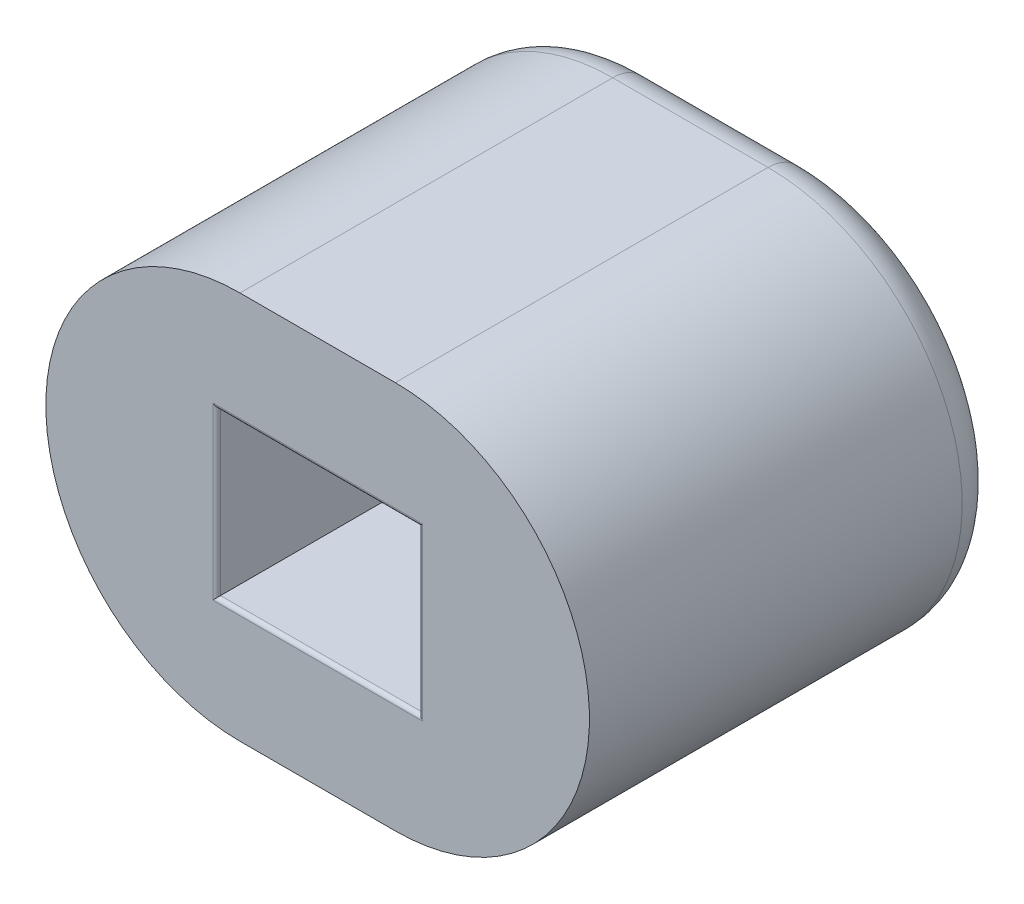
ISO-10303-21;
HEADER;
FILE_DESCRIPTION(('STEP AP214'),'2;1');
FILE_NAME('part.step','',(''),(''),'','','');
FILE_SCHEMA(('AUTOMOTIVE_DESIGN { 1 0 10303 214 1 1 1 1 }'));
ENDSEC;
DATA;
#1=APPLICATION_CONTEXT('core data for automotive mechanical design processes');
#2=APPLICATION_PROTOCOL_DEFINITION('international standard','automotive_design',2000,#1);
#3=PRODUCT_CONTEXT('',#1,'mechanical');
#4=PRODUCT('Part','Part','',(#3));
#5=PRODUCT_RELATED_PRODUCT_CATEGORY('part','',(#4));
#6=PRODUCT_DEFINITION_FORMATION('','',#4);
#7=PRODUCT_DEFINITION_CONTEXT('part definition',#1,'design');
#8=PRODUCT_DEFINITION('design','',#6,#7);
#9=PRODUCT_DEFINITION_SHAPE('','',#8);
#10=(LENGTH_UNIT() NAMED_UNIT(*) SI_UNIT(.MILLI.,.METRE.));
#11=(NAMED_UNIT(*) PLANE_ANGLE_UNIT() SI_UNIT($,.RADIAN.));
#12=(NAMED_UNIT(*) SI_UNIT($,.STERADIAN.) SOLID_ANGLE_UNIT());
#13=UNCERTAINTY_MEASURE_WITH_UNIT(LENGTH_MEASURE(1.E-05),#10,'distance_accuracy_value','');
#14=(GEOMETRIC_REPRESENTATION_CONTEXT(3) GLOBAL_UNCERTAINTY_ASSIGNED_CONTEXT((#13)) GLOBAL_UNIT_ASSIGNED_CONTEXT((#10,
#11,#12)) REPRESENTATION_CONTEXT('',''));
#15=CARTESIAN_POINT('',(0.,0.,0.));
#16=DIRECTION('',(0.,0.,1.));
#17=DIRECTION('',(1.,0.,0.));
#18=AXIS2_PLACEMENT_3D('',#15,#16,#17);
#19=CARTESIAN_POINT('',(0.,-50.8,-56.1));
#20=DIRECTION('',(0.,0.,-1.));
#21=DIRECTION('',(-1.,0.,0.));
#22=AXIS2_PLACEMENT_3D('',#19,#20,#21);
#23=PLANE('',#22);
#24=CARTESIAN_POINT('',(26.1,-49.2289699396619,-56.1));
#25=DIRECTION('',(0.,0.,-1.));
#26=DIRECTION('',(-1.,0.,0.));
#27=AXIS2_PLACEMENT_3D('',#24,#25,#26);
#28=CIRCLE('',#27,0.749999999999998);
#29=CARTESIAN_POINT('',(26.25,-48.4941230168269,-56.1));
#30=VERTEX_POINT('',#29);
#31=CARTESIAN_POINT('',(25.95,-48.4941230168269,-56.1));
#32=VERTEX_POINT('',#31);
#33=EDGE_CURVE('E191',#30,#32,#28,.T.);
#34=ORIENTED_EDGE('',*,*,#33,.F.);
#35=CARTESIAN_POINT('',(26.25,-48.519676619965,-56.1));
#36=DIRECTION('',(0.,0.,-1.));
#37=DIRECTION('',(-1.,0.,0.));
#38=AXIS2_PLACEMENT_3D('',#35,#36,#37);
#39=CIRCLE('',#38,0.0255536031380425);
#40=CARTESIAN_POINT('',(26.25,-48.545230223103,-56.1));
#41=VERTEX_POINT('',#40);
#42=EDGE_CURVE('E208',#30,#41,#39,.F.);
#43=ORIENTED_EDGE('',*,*,#42,.T.);
#44=CARTESIAN_POINT('',(26.1,-49.2289699396619,-56.1));
#45=DIRECTION('',(0.,0.,-1.));
#46=DIRECTION('',(-1.,0.,0.));
#47=AXIS2_PLACEMENT_3D('',#44,#45,#46);
#48=CIRCLE('',#47,0.699999999999999);
#49=CARTESIAN_POINT('',(25.95,-48.545230223103,-56.1));
#50=VERTEX_POINT('',#49);
#51=EDGE_CURVE('E211',#41,#50,#48,.T.);
#52=ORIENTED_EDGE('',*,*,#51,.T.);
#53=CARTESIAN_POINT('',(25.95,-48.519676619965,-56.1));
#54=DIRECTION('',(0.,0.,-1.));
#55=DIRECTION('',(-1.,0.,0.));
#56=AXIS2_PLACEMENT_3D('',#53,#54,#55);
#57=CIRCLE('',#56,0.0255536031380425);
#58=EDGE_CURVE('E220',#32,#50,#57,.T.);
#59=ORIENTED_EDGE('',*,*,#58,.F.);
#60=EDGE_LOOP('',(#34,#43,#52,#59));
#61=FACE_BOUND('',#60,.T.);
#62=CARTESIAN_POINT('',(27.1,-49.2289699396619,-56.1));
#63=DIRECTION('',(0.,0.,-1.));
#64=DIRECTION('',(-1.,0.,0.));
#65=AXIS2_PLACEMENT_3D('',#62,#63,#64);
#66=CIRCLE('',#65,2.);
#67=CARTESIAN_POINT('',(27.1,-47.2289699396619,-56.1));
#68=VERTEX_POINT('',#67);
#69=CARTESIAN_POINT('',(27.1,-51.2289699396619,-56.1));
#70=VERTEX_POINT('',#69);
#71=EDGE_CURVE('E289',#68,#70,#66,.T.);
#72=ORIENTED_EDGE('',*,*,#71,.T.);
#73=DIRECTION('',(-1.,0.,0.));
#74=VECTOR('',#73,1.);
#75=CARTESIAN_POINT('',(25.1,-51.2289699396619,-56.1));
#76=LINE('',#75,#74);
#77=CARTESIAN_POINT('',(25.1,-51.2289699396619,-56.1));
#78=VERTEX_POINT('',#77);
#79=EDGE_CURVE('E291',#70,#78,#76,.T.);
#80=ORIENTED_EDGE('',*,*,#79,.T.);
#81=CARTESIAN_POINT('',(25.1,-49.2289699396619,-56.1));
#82=DIRECTION('',(0.,0.,-1.));
#83=DIRECTION('',(-1.,0.,0.));
#84=AXIS2_PLACEMENT_3D('',#81,#82,#83);
#85=CIRCLE('',#84,2.);
#86=CARTESIAN_POINT('',(25.1,-47.2289699396619,-56.1));
#87=VERTEX_POINT('',#86);
#88=EDGE_CURVE('E285',#78,#87,#85,.T.);
#89=ORIENTED_EDGE('',*,*,#88,.T.);
#90=DIRECTION('',(1.,0.,0.));
#91=VECTOR('',#90,1.);
#92=CARTESIAN_POINT('',(27.1,-47.2289699396619,-56.1));
#93=LINE('',#92,#91);
#94=EDGE_CURVE('E287',#87,#68,#93,.T.);
#95=ORIENTED_EDGE('',*,*,#94,.T.);
#96=EDGE_LOOP('',(#72,#80,#89,#95));
#97=FACE_BOUND('',#96,.T.);
#98=CARTESIAN_POINT('',(26.1,-49.2289699396619,-56.1));
#99=DIRECTION('',(0.,0.,-1.));
#100=DIRECTION('',(-1.,0.,0.));
#101=AXIS2_PLACEMENT_3D('',#98,#99,#100);
#102=CIRCLE('',#101,0.0500000000000014);
#103=CARTESIAN_POINT('',(26.15,-49.2289699396619,-56.1));
#104=VERTEX_POINT('',#103);
#105=CARTESIAN_POINT('',(26.05,-49.2289699396619,-56.1));
#106=VERTEX_POINT('',#105);
#107=EDGE_CURVE('E246',#104,#106,#102,.T.);
#108=ORIENTED_EDGE('',*,*,#107,.F.);
#109=DIRECTION('',(0.,1.,0.));
#110=VECTOR('',#109,1.);
#111=CARTESIAN_POINT('',(26.15,-50.8,-56.1));
#112=LINE('',#111,#110);
#113=CARTESIAN_POINT('',(26.15,-48.2289699396619,-56.1));
#114=VERTEX_POINT('',#113);
#115=EDGE_CURVE('E227',#104,#114,#112,.T.);
#116=ORIENTED_EDGE('',*,*,#115,.T.);
#117=CARTESIAN_POINT('',(26.1,-48.2289699396619,-56.1));
#118=DIRECTION('',(0.,0.,-1.));
#119=DIRECTION('',(-1.,0.,0.));
#120=AXIS2_PLACEMENT_3D('',#117,#118,#119);
#121=CIRCLE('',#120,0.0500000000000014);
#122=CARTESIAN_POINT('',(26.05,-48.2289699396619,-56.1));
#123=VERTEX_POINT('',#122);
#124=EDGE_CURVE('E235',#114,#123,#121,.F.);
#125=ORIENTED_EDGE('',*,*,#124,.T.);
#126=DIRECTION('',(0.,1.,0.));
#127=VECTOR('',#126,1.);
#128=CARTESIAN_POINT('',(26.05,-50.8,-56.1));
#129=LINE('',#128,#127);
#130=EDGE_CURVE('E249',#106,#123,#129,.T.);
#131=ORIENTED_EDGE('',*,*,#130,.F.);
#132=EDGE_LOOP('',(#108,#116,#125,#131));
#133=FACE_BOUND('',#132,.T.);
#134=ADVANCED_FACE('F34',(#61,#97,#133),#23,.T.);
#135=CARTESIAN_POINT('',(0.,-46.7289699396619,-56.1));
#136=DIRECTION('',(0.,-1.,0.));
#137=DIRECTION('',(0.,0.,-1.));
#138=AXIS2_PLACEMENT_3D('',#135,#136,#137);
#139=PLANE('',#138);
#140=DIRECTION('',(0.,0.,1.));
#141=VECTOR('',#140,1.);
#142=CARTESIAN_POINT('',(27.1,-46.7289699396619,-56.1));
#143=LINE('',#142,#141);
#144=CARTESIAN_POINT('',(27.1,-46.7289699396619,-55.6));
#145=VERTEX_POINT('',#144);
#146=CARTESIAN_POINT('',(27.1,-46.7289699396619,-50.8));
#147=VERTEX_POINT('',#146);
#148=EDGE_CURVE('E283',#145,#147,#143,.T.);
#149=ORIENTED_EDGE('',*,*,#148,.F.);
#150=DIRECTION('',(1.,0.,0.));
#151=VECTOR('',#150,1.);
#152=CARTESIAN_POINT('',(25.1,-46.7289699396619,-55.6));
#153=LINE('',#152,#151);
#154=CARTESIAN_POINT('',(25.1,-46.7289699396619,-55.6));
#155=VERTEX_POINT('',#154);
#156=EDGE_CURVE('E299',#145,#155,#153,.F.);
#157=ORIENTED_EDGE('',*,*,#156,.T.);
#158=DIRECTION('',(0.,0.,1.));
#159=VECTOR('',#158,1.);
#160=CARTESIAN_POINT('',(25.1,-46.7289699396619,-56.1));
#161=LINE('',#160,#159);
#162=CARTESIAN_POINT('',(25.1,-46.7289699396619,-50.8));
#163=VERTEX_POINT('',#162);
#164=EDGE_CURVE('E277',#155,#163,#161,.T.);
#165=ORIENTED_EDGE('',*,*,#164,.T.);
#166=DIRECTION('',(1.,0.,0.));
#167=VECTOR('',#166,1.);
#168=CARTESIAN_POINT('',(0.,-46.7289699396619,-50.8));
#169=LINE('',#168,#167);
#170=EDGE_CURVE('E264',#163,#147,#169,.T.);
#171=ORIENTED_EDGE('',*,*,#170,.T.);
#172=EDGE_LOOP('',(#149,#157,#165,#171));
#173=FACE_BOUND('',#172,.T.);
#174=ADVANCED_FACE('F425',(#173),#139,.F.);
#175=CARTESIAN_POINT('',(27.1,-49.2289699396619,-56.1));
#176=DIRECTION('',(0.,0.,1.));
#177=DIRECTION('',(1.,0.,0.));
#178=AXIS2_PLACEMENT_3D('',#175,#176,#177);
#179=CYLINDRICAL_SURFACE('',#178,2.5);
#180=DIRECTION('',(0.,0.,1.));
#181=VECTOR('',#180,1.);
#182=CARTESIAN_POINT('',(27.1,-51.7289699396619,-56.1));
#183=LINE('',#182,#181);
#184=CARTESIAN_POINT('',(27.1,-51.7289699396619,-55.6));
#185=VERTEX_POINT('',#184);
#186=CARTESIAN_POINT('',(27.1,-51.7289699396619,-50.8));
#187=VERTEX_POINT('',#186);
#188=EDGE_CURVE('E281',#185,#187,#183,.T.);
#189=ORIENTED_EDGE('',*,*,#188,.F.);
#190=CARTESIAN_POINT('',(27.1,-49.2289699396619,-55.6));
#191=DIRECTION('',(0.,0.,-1.));
#192=DIRECTION('',(-1.,0.,0.));
#193=AXIS2_PLACEMENT_3D('',#190,#191,#192);
#194=CIRCLE('',#193,2.5);
#195=EDGE_CURVE('E297',#185,#145,#194,.F.);
#196=ORIENTED_EDGE('',*,*,#195,.T.);
#197=ORIENTED_EDGE('',*,*,#148,.T.);
#198=CARTESIAN_POINT('',(27.1,-49.2289699396619,-50.8));
#199=DIRECTION('',(0.,0.,-1.));
#200=DIRECTION('',(-1.,0.,0.));
#201=AXIS2_PLACEMENT_3D('',#198,#199,#200);
#202=CIRCLE('',#201,2.5);
#203=EDGE_CURVE('E267',#147,#187,#202,.T.);
#204=ORIENTED_EDGE('',*,*,#203,.T.);
#205=EDGE_LOOP('',(#189,#196,#197,#204));
#206=FACE_BOUND('',#205,.T.);
#207=ADVANCED_FACE('F431',(#206),#179,.T.);
#208=CARTESIAN_POINT('',(0.,-51.7289699396619,-56.1));
#209=DIRECTION('',(0.,1.,0.));
#210=DIRECTION('',(-1.,0.,0.));
#211=AXIS2_PLACEMENT_3D('',#208,#209,#210);
#212=PLANE('',#211);
#213=DIRECTION('',(0.,0.,1.));
#214=VECTOR('',#213,1.);
#215=CARTESIAN_POINT('',(25.1,-51.7289699396619,-56.1));
#216=LINE('',#215,#214);
#217=CARTESIAN_POINT('',(25.1,-51.7289699396619,-55.6));
#218=VERTEX_POINT('',#217);
#219=CARTESIAN_POINT('',(25.1,-51.7289699396619,-50.8));
#220=VERTEX_POINT('',#219);
#221=EDGE_CURVE('E279',#218,#220,#216,.T.);
#222=ORIENTED_EDGE('',*,*,#221,.F.);
#223=DIRECTION('',(-1.,0.,0.));
#224=VECTOR('',#223,1.);
#225=CARTESIAN_POINT('',(27.1,-51.7289699396619,-55.6));
#226=LINE('',#225,#224);
#227=EDGE_CURVE('E294',#218,#185,#226,.F.);
#228=ORIENTED_EDGE('',*,*,#227,.T.);
#229=ORIENTED_EDGE('',*,*,#188,.T.);
#230=DIRECTION('',(-1.,0.,0.));
#231=VECTOR('',#230,1.);
#232=CARTESIAN_POINT('',(0.,-51.7289699396619,-50.8));
#233=LINE('',#232,#231);
#234=EDGE_CURVE('E271',#187,#220,#233,.T.);
#235=ORIENTED_EDGE('',*,*,#234,.T.);
#236=EDGE_LOOP('',(#222,#228,#229,#235));
#237=FACE_BOUND('',#236,.T.);
#238=ADVANCED_FACE('F445',(#237),#212,.F.);
#239=CARTESIAN_POINT('',(25.1,-49.2289699396619,-56.1));
#240=DIRECTION('',(0.,0.,1.));
#241=DIRECTION('',(1.,0.,0.));
#242=AXIS2_PLACEMENT_3D('',#239,#240,#241);
#243=CYLINDRICAL_SURFACE('',#242,2.5);
#244=ORIENTED_EDGE('',*,*,#164,.F.);
#245=CARTESIAN_POINT('',(25.1,-49.2289699396619,-55.6));
#246=DIRECTION('',(0.,0.,-1.));
#247=DIRECTION('',(-1.,0.,0.));
#248=AXIS2_PLACEMENT_3D('',#245,#246,#247);
#249=CIRCLE('',#248,2.5);
#250=EDGE_CURVE('E301',#155,#218,#249,.F.);
#251=ORIENTED_EDGE('',*,*,#250,.T.);
#252=ORIENTED_EDGE('',*,*,#221,.T.);
#253=CARTESIAN_POINT('',(25.1,-49.2289699396619,-50.8));
#254=DIRECTION('',(0.,0.,-1.));
#255=DIRECTION('',(-1.,0.,0.));
#256=AXIS2_PLACEMENT_3D('',#253,#254,#255);
#257=CIRCLE('',#256,2.5);
#258=EDGE_CURVE('E274',#220,#163,#257,.T.);
#259=ORIENTED_EDGE('',*,*,#258,.T.);
#260=EDGE_LOOP('',(#244,#251,#252,#259));
#261=FACE_BOUND('',#260,.T.);
#262=ADVANCED_FACE('F442',(#261),#243,.T.);
#263=CARTESIAN_POINT('',(0.,-50.8,-50.8));
#264=DIRECTION('',(0.,0.,-1.));
#265=DIRECTION('',(-1.,0.,0.));
#266=AXIS2_PLACEMENT_3D('',#263,#264,#265);
#267=PLANE('',#266);
#268=DIRECTION('',(0.,1.,0.));
#269=VECTOR('',#268,1.);
#270=CARTESIAN_POINT('',(27.45,-50.8,-50.8));
#271=LINE('',#270,#269);
#272=CARTESIAN_POINT('',(27.45,-48.1289699396619,-50.8));
#273=VERTEX_POINT('',#272);
#274=CARTESIAN_POINT('',(27.45,-50.3289699396619,-50.8));
#275=VERTEX_POINT('',#274);
#276=EDGE_CURVE('E344',#273,#275,#271,.F.);
#277=ORIENTED_EDGE('',*,*,#276,.T.);
#278=DIRECTION('',(1.,0.,0.));
#279=VECTOR('',#278,1.);
#280=CARTESIAN_POINT('',(0.,-50.3289699396619,-50.8));
#281=LINE('',#280,#279);
#282=CARTESIAN_POINT('',(24.75,-50.3289699396619,-50.8));
#283=VERTEX_POINT('',#282);
#284=EDGE_CURVE('E348',#275,#283,#281,.F.);
#285=ORIENTED_EDGE('',*,*,#284,.T.);
#286=DIRECTION('',(0.,-1.,0.));
#287=VECTOR('',#286,1.);
#288=CARTESIAN_POINT('',(24.75,-50.8,-50.8));
#289=LINE('',#288,#287);
#290=CARTESIAN_POINT('',(24.75,-48.1289699396619,-50.8));
#291=VERTEX_POINT('',#290);
#292=EDGE_CURVE('E346',#283,#291,#289,.F.);
#293=ORIENTED_EDGE('',*,*,#292,.T.);
#294=DIRECTION('',(-1.,0.,0.));
#295=VECTOR('',#294,1.);
#296=CARTESIAN_POINT('',(0.,-48.1289699396619,-50.8));
#297=LINE('',#296,#295);
#298=EDGE_CURVE('E342',#291,#273,#297,.F.);
#299=ORIENTED_EDGE('',*,*,#298,.T.);
#300=EDGE_LOOP('',(#277,#285,#293,#299));
#301=FACE_BOUND('',#300,.T.);
#302=ORIENTED_EDGE('',*,*,#170,.F.);
#303=ORIENTED_EDGE('',*,*,#258,.F.);
#304=ORIENTED_EDGE('',*,*,#234,.F.);
#305=ORIENTED_EDGE('',*,*,#203,.F.);
#306=EDGE_LOOP('',(#302,#303,#304,#305));
#307=FACE_BOUND('',#306,.T.);
#308=ADVANCED_FACE('F372',(#301,#307),#267,.F.);
#309=CARTESIAN_POINT('',(0.,-47.2289699396619,-55.6));
#310=DIRECTION('',(-1.,0.,0.));
#311=DIRECTION('',(0.,0.,1.));
#312=AXIS2_PLACEMENT_3D('',#309,#310,#311);
#313=CYLINDRICAL_SURFACE('',#312,0.5);
#314=CARTESIAN_POINT('',(25.1,-47.2289699396619,-55.6));
#315=DIRECTION('',(-1.,0.,0.));
#316=DIRECTION('',(0.,0.,1.));
#317=AXIS2_PLACEMENT_3D('',#314,#315,#316);
#318=CIRCLE('',#317,0.5);
#319=EDGE_CURVE('E307',#155,#87,#318,.T.);
#320=ORIENTED_EDGE('',*,*,#319,.F.);
#321=ORIENTED_EDGE('',*,*,#156,.F.);
#322=CARTESIAN_POINT('',(27.1,-47.2289699396619,-55.6));
#323=DIRECTION('',(1.,0.,0.));
#324=DIRECTION('',(0.,0.,-1.));
#325=AXIS2_PLACEMENT_3D('',#322,#323,#324);
#326=CIRCLE('',#325,0.5);
#327=EDGE_CURVE('E268',#68,#145,#326,.T.);
#328=ORIENTED_EDGE('',*,*,#327,.F.);
#329=ORIENTED_EDGE('',*,*,#94,.F.);
#330=EDGE_LOOP('',(#320,#321,#328,#329));
#331=FACE_BOUND('',#330,.T.);
#332=ADVANCED_FACE('F441',(#331),#313,.T.);
#333=CARTESIAN_POINT('',(27.1,-49.2289699396619,-55.6));
#334=DIRECTION('',(0.,0.,-1.));
#335=DIRECTION('',(-1.,0.,0.));
#336=AXIS2_PLACEMENT_3D('',#333,#334,#335);
#337=TOROIDAL_SURFACE('',#336,2.,0.5);
#338=ORIENTED_EDGE('',*,*,#327,.T.);
#339=ORIENTED_EDGE('',*,*,#195,.F.);
#340=CARTESIAN_POINT('',(27.1,-51.2289699396619,-55.6));
#341=DIRECTION('',(-1.,0.,0.));
#342=DIRECTION('',(0.,0.,1.));
#343=AXIS2_PLACEMENT_3D('',#340,#341,#342);
#344=CIRCLE('',#343,0.5);
#345=EDGE_CURVE('E305',#70,#185,#344,.T.);
#346=ORIENTED_EDGE('',*,*,#345,.F.);
#347=ORIENTED_EDGE('',*,*,#71,.F.);
#348=EDGE_LOOP('',(#338,#339,#346,#347));
#349=FACE_BOUND('',#348,.T.);
#350=ADVANCED_FACE('F460',(#349),#337,.T.);
#351=CARTESIAN_POINT('',(25.1,-49.2289699396619,-55.6));
#352=DIRECTION('',(0.,0.,-1.));
#353=DIRECTION('',(-1.,0.,0.));
#354=AXIS2_PLACEMENT_3D('',#351,#352,#353);
#355=TOROIDAL_SURFACE('',#354,2.,0.5);
#356=ORIENTED_EDGE('',*,*,#319,.T.);
#357=ORIENTED_EDGE('',*,*,#88,.F.);
#358=CARTESIAN_POINT('',(25.1,-51.2289699396619,-55.6));
#359=DIRECTION('',(1.,0.,0.));
#360=DIRECTION('',(0.,0.,-1.));
#361=AXIS2_PLACEMENT_3D('',#358,#359,#360);
#362=CIRCLE('',#361,0.5);
#363=EDGE_CURVE('E257',#218,#78,#362,.T.);
#364=ORIENTED_EDGE('',*,*,#363,.F.);
#365=ORIENTED_EDGE('',*,*,#250,.F.);
#366=EDGE_LOOP('',(#356,#357,#364,#365));
#367=FACE_BOUND('',#366,.T.);
#368=ADVANCED_FACE('F456',(#367),#355,.T.);
#369=CARTESIAN_POINT('',(0.,-51.2289699396619,-55.6));
#370=DIRECTION('',(1.,0.,0.));
#371=DIRECTION('',(0.,1.,0.));
#372=AXIS2_PLACEMENT_3D('',#369,#370,#371);
#373=CYLINDRICAL_SURFACE('',#372,0.5);
#374=ORIENTED_EDGE('',*,*,#345,.T.);
#375=ORIENTED_EDGE('',*,*,#227,.F.);
#376=ORIENTED_EDGE('',*,*,#363,.T.);
#377=ORIENTED_EDGE('',*,*,#79,.F.);
#378=EDGE_LOOP('',(#374,#375,#376,#377));
#379=FACE_BOUND('',#378,.T.);
#380=ADVANCED_FACE('F453',(#379),#373,.T.);
#381=CARTESIAN_POINT('',(26.15,-50.8,-56.));
#382=DIRECTION('',(-1.,0.,0.));
#383=DIRECTION('',(0.,0.,1.));
#384=AXIS2_PLACEMENT_3D('',#381,#382,#383);
#385=PLANE('',#384);
#386=ORIENTED_EDGE('',*,*,#115,.F.);
#387=DIRECTION('',(0.,0.,-1.));
#388=VECTOR('',#387,1.);
#389=CARTESIAN_POINT('',(26.15,-49.2289699396619,-56.));
#390=LINE('',#389,#388);
#391=CARTESIAN_POINT('',(26.15,-49.2289699396619,-56.));
#392=VERTEX_POINT('',#391);
#393=EDGE_CURVE('E243',#392,#104,#390,.T.);
#394=ORIENTED_EDGE('',*,*,#393,.F.);
#395=DIRECTION('',(0.,1.,0.));
#396=VECTOR('',#395,1.);
#397=CARTESIAN_POINT('',(26.15,-50.8,-56.));
#398=LINE('',#397,#396);
#399=CARTESIAN_POINT('',(26.15,-48.2289699396619,-56.));
#400=VERTEX_POINT('',#399);
#401=EDGE_CURVE('E231',#392,#400,#398,.T.);
#402=ORIENTED_EDGE('',*,*,#401,.T.);
#403=DIRECTION('',(0.,0.,-1.));
#404=VECTOR('',#403,1.);
#405=CARTESIAN_POINT('',(26.15,-48.2289699396619,-56.));
#406=LINE('',#405,#404);
#407=EDGE_CURVE('E254',#400,#114,#406,.T.);
#408=ORIENTED_EDGE('',*,*,#407,.T.);
#409=EDGE_LOOP('',(#386,#394,#402,#408));
#410=FACE_BOUND('',#409,.T.);
#411=ADVANCED_FACE('F437',(#410),#385,.T.);
#412=CARTESIAN_POINT('',(26.1,-48.2289699396619,-56.));
#413=DIRECTION('',(0.,0.,-1.));
#414=DIRECTION('',(-1.,0.,0.));
#415=AXIS2_PLACEMENT_3D('',#412,#413,#414);
#416=CYLINDRICAL_SURFACE('',#415,0.0500000000000014);
#417=ORIENTED_EDGE('',*,*,#124,.F.);
#418=ORIENTED_EDGE('',*,*,#407,.F.);
#419=CARTESIAN_POINT('',(26.1,-48.2289699396619,-56.));
#420=DIRECTION('',(0.,0.,-1.));
#421=DIRECTION('',(-1.,0.,0.));
#422=AXIS2_PLACEMENT_3D('',#419,#420,#421);
#423=CIRCLE('',#422,0.0500000000000014);
#424=CARTESIAN_POINT('',(26.05,-48.2289699396619,-56.));
#425=VERTEX_POINT('',#424);
#426=EDGE_CURVE('E241',#400,#425,#423,.F.);
#427=ORIENTED_EDGE('',*,*,#426,.T.);
#428=DIRECTION('',(0.,0.,-1.));
#429=VECTOR('',#428,1.);
#430=CARTESIAN_POINT('',(26.05,-48.2289699396619,-56.));
#431=LINE('',#430,#429);
#432=EDGE_CURVE('E258',#425,#123,#431,.T.);
#433=ORIENTED_EDGE('',*,*,#432,.T.);
#434=EDGE_LOOP('',(#417,#418,#427,#433));
#435=FACE_BOUND('',#434,.T.);
#436=ADVANCED_FACE('F603',(#435),#416,.F.);
#437=CARTESIAN_POINT('',(26.05,-50.8,-56.));
#438=DIRECTION('',(-1.,0.,0.));
#439=DIRECTION('',(0.,0.,1.));
#440=AXIS2_PLACEMENT_3D('',#437,#438,#439);
#441=PLANE('',#440);
#442=ORIENTED_EDGE('',*,*,#130,.T.);
#443=ORIENTED_EDGE('',*,*,#432,.F.);
#444=DIRECTION('',(0.,1.,0.));
#445=VECTOR('',#444,1.);
#446=CARTESIAN_POINT('',(26.05,-50.8,-56.));
#447=LINE('',#446,#445);
#448=CARTESIAN_POINT('',(26.05,-49.2289699396619,-56.));
#449=VERTEX_POINT('',#448);
#450=EDGE_CURVE('E238',#449,#425,#447,.T.);
#451=ORIENTED_EDGE('',*,*,#450,.F.);
#452=DIRECTION('',(0.,0.,-1.));
#453=VECTOR('',#452,1.);
#454=CARTESIAN_POINT('',(26.05,-49.2289699396619,-56.));
#455=LINE('',#454,#453);
#456=EDGE_CURVE('E260',#449,#106,#455,.T.);
#457=ORIENTED_EDGE('',*,*,#456,.T.);
#458=EDGE_LOOP('',(#442,#443,#451,#457));
#459=FACE_BOUND('',#458,.T.);
#460=ADVANCED_FACE('F595',(#459),#441,.F.);
#461=CARTESIAN_POINT('',(26.1,-49.2289699396619,-56.));
#462=DIRECTION('',(0.,0.,-1.));
#463=DIRECTION('',(-1.,0.,0.));
#464=AXIS2_PLACEMENT_3D('',#461,#462,#463);
#465=CYLINDRICAL_SURFACE('',#464,0.0500000000000014);
#466=ORIENTED_EDGE('',*,*,#107,.T.);
#467=ORIENTED_EDGE('',*,*,#456,.F.);
#468=CARTESIAN_POINT('',(26.1,-49.2289699396619,-56.));
#469=DIRECTION('',(0.,0.,-1.));
#470=DIRECTION('',(-1.,0.,0.));
#471=AXIS2_PLACEMENT_3D('',#468,#469,#470);
#472=CIRCLE('',#471,0.0500000000000014);
#473=EDGE_CURVE('E234',#392,#449,#472,.T.);
#474=ORIENTED_EDGE('',*,*,#473,.F.);
#475=ORIENTED_EDGE('',*,*,#393,.T.);
#476=EDGE_LOOP('',(#466,#467,#474,#475));
#477=FACE_BOUND('',#476,.T.);
#478=ADVANCED_FACE('F586',(#477),#465,.F.);
#479=CARTESIAN_POINT('',(0.,-50.8,-56.));
#480=DIRECTION('',(0.,0.,-1.));
#481=DIRECTION('',(-1.,0.,0.));
#482=AXIS2_PLACEMENT_3D('',#479,#480,#481);
#483=PLANE('',#482);
#484=ORIENTED_EDGE('',*,*,#401,.F.);
#485=ORIENTED_EDGE('',*,*,#473,.T.);
#486=ORIENTED_EDGE('',*,*,#450,.T.);
#487=ORIENTED_EDGE('',*,*,#426,.F.);
#488=EDGE_LOOP('',(#484,#485,#486,#487));
#489=FACE_BOUND('',#488,.T.);
#490=ADVANCED_FACE('F578',(#489),#483,.T.);
#491=CARTESIAN_POINT('',(26.1,-49.2289699396619,-56.));
#492=DIRECTION('',(0.,0.,-1.));
#493=DIRECTION('',(-1.,0.,0.));
#494=AXIS2_PLACEMENT_3D('',#491,#492,#493);
#495=CYLINDRICAL_SURFACE('',#494,0.749999999999998);
#496=ORIENTED_EDGE('',*,*,#33,.T.);
#497=DIRECTION('',(0.,0.,-1.));
#498=VECTOR('',#497,1.);
#499=CARTESIAN_POINT('',(25.95,-48.4941230168269,-56.));
#500=LINE('',#499,#498);
#501=CARTESIAN_POINT('',(25.95,-48.4941230168269,-56.));
#502=VERTEX_POINT('',#501);
#503=EDGE_CURVE('E185',#502,#32,#500,.T.);
#504=ORIENTED_EDGE('',*,*,#503,.F.);
#505=CARTESIAN_POINT('',(26.1,-49.2289699396619,-56.));
#506=DIRECTION('',(0.,0.,-1.));
#507=DIRECTION('',(-1.,0.,0.));
#508=AXIS2_PLACEMENT_3D('',#505,#506,#507);
#509=CIRCLE('',#508,0.749999999999998);
#510=CARTESIAN_POINT('',(26.25,-48.4941230168269,-56.));
#511=VERTEX_POINT('',#510);
#512=EDGE_CURVE('E189',#511,#502,#509,.T.);
#513=ORIENTED_EDGE('',*,*,#512,.F.);
#514=DIRECTION('',(0.,0.,-1.));
#515=VECTOR('',#514,1.);
#516=CARTESIAN_POINT('',(26.25,-48.4941230168269,-56.));
#517=LINE('',#516,#515);
#518=EDGE_CURVE('E225',#511,#30,#517,.T.);
#519=ORIENTED_EDGE('',*,*,#518,.T.);
#520=EDGE_LOOP('',(#496,#504,#513,#519));
#521=FACE_BOUND('',#520,.T.);
#522=ADVANCED_FACE('F187',(#521),#495,.F.);
#523=CARTESIAN_POINT('',(26.25,-48.519676619965,-56.));
#524=DIRECTION('',(0.,0.,-1.));
#525=DIRECTION('',(-1.,0.,0.));
#526=AXIS2_PLACEMENT_3D('',#523,#524,#525);
#527=CYLINDRICAL_SURFACE('',#526,0.0255536031380425);
#528=ORIENTED_EDGE('',*,*,#42,.F.);
#529=ORIENTED_EDGE('',*,*,#518,.F.);
#530=CARTESIAN_POINT('',(26.25,-48.519676619965,-56.));
#531=DIRECTION('',(0.,0.,-1.));
#532=DIRECTION('',(-1.,0.,0.));
#533=AXIS2_PLACEMENT_3D('',#530,#531,#532);
#534=CIRCLE('',#533,0.0255536031380425);
#535=CARTESIAN_POINT('',(26.25,-48.545230223103,-56.));
#536=VERTEX_POINT('',#535);
#537=EDGE_CURVE('E196',#511,#536,#534,.F.);
#538=ORIENTED_EDGE('',*,*,#537,.T.);
#539=DIRECTION('',(0.,0.,-1.));
#540=VECTOR('',#539,1.);
#541=CARTESIAN_POINT('',(26.25,-48.545230223103,-56.));
#542=LINE('',#541,#540);
#543=EDGE_CURVE('E228',#536,#41,#542,.T.);
#544=ORIENTED_EDGE('',*,*,#543,.T.);
#545=EDGE_LOOP('',(#528,#529,#538,#544));
#546=FACE_BOUND('',#545,.T.);
#547=ADVANCED_FACE('F561',(#546),#527,.F.);
#548=CARTESIAN_POINT('',(26.1,-49.2289699396619,-56.));
#549=DIRECTION('',(0.,0.,-1.));
#550=DIRECTION('',(-1.,0.,0.));
#551=AXIS2_PLACEMENT_3D('',#548,#549,#550);
#552=CYLINDRICAL_SURFACE('',#551,0.699999999999999);
#553=ORIENTED_EDGE('',*,*,#51,.F.);
#554=ORIENTED_EDGE('',*,*,#543,.F.);
#555=CARTESIAN_POINT('',(26.1,-49.2289699396619,-56.));
#556=DIRECTION('',(0.,0.,-1.));
#557=DIRECTION('',(-1.,0.,0.));
#558=AXIS2_PLACEMENT_3D('',#555,#556,#557);
#559=CIRCLE('',#558,0.699999999999999);
#560=CARTESIAN_POINT('',(25.95,-48.545230223103,-56.));
#561=VERTEX_POINT('',#560);
#562=EDGE_CURVE('E204',#536,#561,#559,.T.);
#563=ORIENTED_EDGE('',*,*,#562,.T.);
#564=DIRECTION('',(0.,0.,-1.));
#565=VECTOR('',#564,1.);
#566=CARTESIAN_POINT('',(25.95,-48.545230223103,-56.));
#567=LINE('',#566,#565);
#568=EDGE_CURVE('E195',#561,#50,#567,.T.);
#569=ORIENTED_EDGE('',*,*,#568,.T.);
#570=EDGE_LOOP('',(#553,#554,#563,#569));
#571=FACE_BOUND('',#570,.T.);
#572=ADVANCED_FACE('F553',(#571),#552,.T.);
#573=CARTESIAN_POINT('',(25.95,-48.519676619965,-56.));
#574=DIRECTION('',(0.,0.,-1.));
#575=DIRECTION('',(-1.,0.,0.));
#576=AXIS2_PLACEMENT_3D('',#573,#574,#575);
#577=CYLINDRICAL_SURFACE('',#576,0.0255536031380425);
#578=ORIENTED_EDGE('',*,*,#58,.T.);
#579=ORIENTED_EDGE('',*,*,#568,.F.);
#580=CARTESIAN_POINT('',(25.95,-48.519676619965,-56.));
#581=DIRECTION('',(0.,0.,-1.));
#582=DIRECTION('',(-1.,0.,0.));
#583=AXIS2_PLACEMENT_3D('',#580,#581,#582);
#584=CIRCLE('',#583,0.0255536031380425);
#585=EDGE_CURVE('E200',#502,#561,#584,.T.);
#586=ORIENTED_EDGE('',*,*,#585,.F.);
#587=ORIENTED_EDGE('',*,*,#503,.T.);
#588=EDGE_LOOP('',(#578,#579,#586,#587));
#589=FACE_BOUND('',#588,.T.);
#590=ADVANCED_FACE('F201',(#589),#577,.F.);
#591=CARTESIAN_POINT('',(0.,-50.8,-56.));
#592=DIRECTION('',(0.,0.,-1.));
#593=DIRECTION('',(-1.,0.,0.));
#594=AXIS2_PLACEMENT_3D('',#591,#592,#593);
#595=PLANE('',#594);
#596=ORIENTED_EDGE('',*,*,#512,.T.);
#597=ORIENTED_EDGE('',*,*,#585,.T.);
#598=ORIENTED_EDGE('',*,*,#562,.F.);
#599=ORIENTED_EDGE('',*,*,#537,.F.);
#600=EDGE_LOOP('',(#596,#597,#598,#599));
#601=FACE_BOUND('',#600,.T.);
#602=ADVANCED_FACE('F207',(#601),#595,.T.);
#603=CARTESIAN_POINT('',(0.,-48.1789699396619,-53.3));
#604=DIRECTION('',(0.,1.,0.));
#605=DIRECTION('',(0.,0.,1.));
#606=AXIS2_PLACEMENT_3D('',#603,#604,#605);
#607=PLANE('',#606);
#608=DIRECTION('',(0.,0.,1.));
#609=VECTOR('',#608,1.);
#610=CARTESIAN_POINT('',(27.4,-48.1789699396619,-53.3));
#611=LINE('',#610,#609);
#612=CARTESIAN_POINT('',(27.4,-48.1789699396619,-53.25));
#613=VERTEX_POINT('',#612);
#614=CARTESIAN_POINT('',(27.4,-48.1789699396619,-50.85));
#615=VERTEX_POINT('',#614);
#616=EDGE_CURVE('E221',#613,#615,#611,.T.);
#617=ORIENTED_EDGE('',*,*,#616,.T.);
#618=DIRECTION('',(-1.,0.,0.));
#619=VECTOR('',#618,1.);
#620=CARTESIAN_POINT('',(0.,-48.1789699396619,-50.85));
#621=LINE('',#620,#619);
#622=CARTESIAN_POINT('',(24.8,-48.1789699396619,-50.85));
#623=VERTEX_POINT('',#622);
#624=EDGE_CURVE('E11',#615,#623,#621,.T.);
#625=ORIENTED_EDGE('',*,*,#624,.T.);
#626=DIRECTION('',(0.,0.,1.));
#627=VECTOR('',#626,1.);
#628=CARTESIAN_POINT('',(24.8,-48.1789699396619,-53.3));
#629=LINE('',#628,#627);
#630=CARTESIAN_POINT('',(24.8,-48.1789699396619,-53.25));
#631=VERTEX_POINT('',#630);
#632=EDGE_CURVE('E214',#631,#623,#629,.T.);
#633=ORIENTED_EDGE('',*,*,#632,.F.);
#634=DIRECTION('',(-1.,0.,0.));
#635=VECTOR('',#634,1.);
#636=CARTESIAN_POINT('',(0.,-48.1789699396619,-53.25));
#637=LINE('',#636,#635);
#638=EDGE_CURVE('E327',#631,#613,#637,.F.);
#639=ORIENTED_EDGE('',*,*,#638,.T.);
#640=EDGE_LOOP('',(#617,#625,#633,#639));
#641=FACE_BOUND('',#640,.T.);
#642=ADVANCED_FACE('F395',(#641),#607,.F.);
#643=CARTESIAN_POINT('',(27.4,-50.8,-53.3));
#644=DIRECTION('',(1.,0.,0.));
#645=DIRECTION('',(0.,0.,-1.));
#646=AXIS2_PLACEMENT_3D('',#643,#644,#645);
#647=PLANE('',#646);
#648=DIRECTION('',(0.,0.,1.));
#649=VECTOR('',#648,1.);
#650=CARTESIAN_POINT('',(27.4,-50.2789699396619,-53.3));
#651=LINE('',#650,#649);
#652=CARTESIAN_POINT('',(27.4,-50.2789699396619,-53.25));
#653=VERTEX_POINT('',#652);
#654=CARTESIAN_POINT('',(27.4,-50.2789699396619,-50.85));
#655=VERTEX_POINT('',#654);
#656=EDGE_CURVE('E384',#653,#655,#651,.T.);
#657=ORIENTED_EDGE('',*,*,#656,.T.);
#658=DIRECTION('',(0.,1.,0.));
#659=VECTOR('',#658,1.);
#660=CARTESIAN_POINT('',(27.4,-50.8,-50.85));
#661=LINE('',#660,#659);
#662=EDGE_CURVE('E43',#655,#615,#661,.T.);
#663=ORIENTED_EDGE('',*,*,#662,.T.);
#664=ORIENTED_EDGE('',*,*,#616,.F.);
#665=DIRECTION('',(0.,1.,0.));
#666=VECTOR('',#665,1.);
#667=CARTESIAN_POINT('',(27.4,-50.8,-53.25));
#668=LINE('',#667,#666);
#669=EDGE_CURVE('E320',#613,#653,#668,.F.);
#670=ORIENTED_EDGE('',*,*,#669,.T.);
#671=EDGE_LOOP('',(#657,#663,#664,#670));
#672=FACE_BOUND('',#671,.T.);
#673=ADVANCED_FACE('F387',(#672),#647,.F.);
#674=CARTESIAN_POINT('',(0.,-50.2789699396619,-53.3));
#675=DIRECTION('',(0.,-1.,0.));
#676=DIRECTION('',(0.,0.,-1.));
#677=AXIS2_PLACEMENT_3D('',#674,#675,#676);
#678=PLANE('',#677);
#679=DIRECTION('',(0.,0.,1.));
#680=VECTOR('',#679,1.);
#681=CARTESIAN_POINT('',(24.8,-50.2789699396619,-53.3));
#682=LINE('',#681,#680);
#683=CARTESIAN_POINT('',(24.8,-50.2789699396619,-53.25));
#684=VERTEX_POINT('',#683);
#685=CARTESIAN_POINT('',(24.8,-50.2789699396619,-50.85));
#686=VERTEX_POINT('',#685);
#687=EDGE_CURVE('E386',#684,#686,#682,.T.);
#688=ORIENTED_EDGE('',*,*,#687,.T.);
#689=DIRECTION('',(1.,0.,0.));
#690=VECTOR('',#689,1.);
#691=CARTESIAN_POINT('',(0.,-50.2789699396619,-50.85));
#692=LINE('',#691,#690);
#693=EDGE_CURVE('E329',#686,#655,#692,.T.);
#694=ORIENTED_EDGE('',*,*,#693,.T.);
#695=ORIENTED_EDGE('',*,*,#656,.F.);
#696=DIRECTION('',(1.,0.,0.));
#697=VECTOR('',#696,1.);
#698=CARTESIAN_POINT('',(0.,-50.2789699396619,-53.25));
#699=LINE('',#698,#697);
#700=EDGE_CURVE('E323',#653,#684,#699,.F.);
#701=ORIENTED_EDGE('',*,*,#700,.T.);
#702=EDGE_LOOP('',(#688,#694,#695,#701));
#703=FACE_BOUND('',#702,.T.);
#704=ADVANCED_FACE('F383',(#703),#678,.F.);
#705=CARTESIAN_POINT('',(24.8,-50.8,-53.3));
#706=DIRECTION('',(-1.,0.,0.));
#707=DIRECTION('',(0.,0.,1.));
#708=AXIS2_PLACEMENT_3D('',#705,#706,#707);
#709=PLANE('',#708);
#710=ORIENTED_EDGE('',*,*,#632,.T.);
#711=DIRECTION('',(0.,-1.,0.));
#712=VECTOR('',#711,1.);
#713=CARTESIAN_POINT('',(24.8,-50.8,-50.85));
#714=LINE('',#713,#712);
#715=EDGE_CURVE('E351',#623,#686,#714,.T.);
#716=ORIENTED_EDGE('',*,*,#715,.T.);
#717=ORIENTED_EDGE('',*,*,#687,.F.);
#718=DIRECTION('',(0.,-1.,0.));
#719=VECTOR('',#718,1.);
#720=CARTESIAN_POINT('',(24.8,-50.8,-53.25));
#721=LINE('',#720,#719);
#722=EDGE_CURVE('E325',#684,#631,#721,.F.);
#723=ORIENTED_EDGE('',*,*,#722,.T.);
#724=EDGE_LOOP('',(#710,#716,#717,#723));
#725=FACE_BOUND('',#724,.T.);
#726=ADVANCED_FACE('F392',(#725),#709,.F.);
#727=CARTESIAN_POINT('',(0.,-50.8,-53.3));
#728=DIRECTION('',(0.,0.,1.));
#729=DIRECTION('',(1.,0.,0.));
#730=AXIS2_PLACEMENT_3D('',#727,#728,#729);
#731=PLANE('',#730);
#732=DIRECTION('',(1.,0.,0.));
#733=VECTOR('',#732,1.);
#734=CARTESIAN_POINT('',(0.,-50.2289699396619,-53.3));
#735=LINE('',#734,#733);
#736=CARTESIAN_POINT('',(24.85,-50.2289699396619,-53.3));
#737=VERTEX_POINT('',#736);
#738=CARTESIAN_POINT('',(27.35,-50.2289699396619,-53.3));
#739=VERTEX_POINT('',#738);
#740=EDGE_CURVE('E315',#737,#739,#735,.T.);
#741=ORIENTED_EDGE('',*,*,#740,.T.);
#742=DIRECTION('',(0.,1.,0.));
#743=VECTOR('',#742,1.);
#744=CARTESIAN_POINT('',(27.35,-50.8,-53.3));
#745=LINE('',#744,#743);
#746=CARTESIAN_POINT('',(27.35,-48.2289699396619,-53.3));
#747=VERTEX_POINT('',#746);
#748=EDGE_CURVE('E317',#739,#747,#745,.T.);
#749=ORIENTED_EDGE('',*,*,#748,.T.);
#750=DIRECTION('',(-1.,0.,0.));
#751=VECTOR('',#750,1.);
#752=CARTESIAN_POINT('',(0.,-48.2289699396619,-53.3));
#753=LINE('',#752,#751);
#754=CARTESIAN_POINT('',(24.85,-48.2289699396619,-53.3));
#755=VERTEX_POINT('',#754);
#756=EDGE_CURVE('E303',#747,#755,#753,.T.);
#757=ORIENTED_EDGE('',*,*,#756,.T.);
#758=DIRECTION('',(0.,-1.,0.));
#759=VECTOR('',#758,1.);
#760=CARTESIAN_POINT('',(24.85,-50.8,-53.3));
#761=LINE('',#760,#759);
#762=EDGE_CURVE('E313',#755,#737,#761,.T.);
#763=ORIENTED_EDGE('',*,*,#762,.T.);
#764=EDGE_LOOP('',(#741,#749,#757,#763));
#765=FACE_BOUND('',#764,.T.);
#766=ADVANCED_FACE('F414',(#765),#731,.T.);
#767=CARTESIAN_POINT('',(24.85,-50.8,-53.25));
#768=DIRECTION('',(0.,-1.,0.));
#769=DIRECTION('',(0.,0.,-1.));
#770=AXIS2_PLACEMENT_3D('',#767,#768,#769);
#771=CYLINDRICAL_SURFACE('',#770,0.05);
#772=CARTESIAN_POINT('',(24.85,-48.2289699396619,-53.25));
#773=DIRECTION('',(-0.707106781186547,-0.707106781186547,0.));
#774=DIRECTION('',(0.707106781186547,-0.707106781186547,0.));
#775=AXIS2_PLACEMENT_3D('',#772,#773,#774);
#776=ELLIPSE('',#775,0.0707106781186548,0.05);
#777=EDGE_CURVE('E334',#631,#755,#776,.T.);
#778=ORIENTED_EDGE('',*,*,#777,.F.);
#779=ORIENTED_EDGE('',*,*,#722,.F.);
#780=CARTESIAN_POINT('',(24.85,-50.2289699396619,-53.25));
#781=DIRECTION('',(0.707106781186547,-0.707106781186547,0.));
#782=DIRECTION('',(0.707106781186547,0.707106781186547,0.));
#783=AXIS2_PLACEMENT_3D('',#780,#781,#782);
#784=ELLIPSE('',#783,0.0707106781186548,0.05);
#785=EDGE_CURVE('E337',#737,#684,#784,.F.);
#786=ORIENTED_EDGE('',*,*,#785,.F.);
#787=ORIENTED_EDGE('',*,*,#762,.F.);
#788=EDGE_LOOP('',(#778,#779,#786,#787));
#789=FACE_BOUND('',#788,.T.);
#790=ADVANCED_FACE('F399',(#789),#771,.F.);
#791=CARTESIAN_POINT('',(0.,-50.2289699396619,-53.25));
#792=DIRECTION('',(1.,0.,0.));
#793=DIRECTION('',(0.,0.,-1.));
#794=AXIS2_PLACEMENT_3D('',#791,#792,#793);
#795=CYLINDRICAL_SURFACE('',#794,0.05);
#796=ORIENTED_EDGE('',*,*,#785,.T.);
#797=ORIENTED_EDGE('',*,*,#700,.F.);
#798=CARTESIAN_POINT('',(27.35,-50.2289699396619,-53.25));
#799=DIRECTION('',(0.707106781186547,0.707106781186547,0.));
#800=DIRECTION('',(-0.707106781186547,0.707106781186547,0.));
#801=AXIS2_PLACEMENT_3D('',#798,#799,#800);
#802=ELLIPSE('',#801,0.0707106781186548,0.05);
#803=EDGE_CURVE('E332',#739,#653,#802,.F.);
#804=ORIENTED_EDGE('',*,*,#803,.F.);
#805=ORIENTED_EDGE('',*,*,#740,.F.);
#806=EDGE_LOOP('',(#796,#797,#804,#805));
#807=FACE_BOUND('',#806,.T.);
#808=ADVANCED_FACE('F412',(#807),#795,.F.);
#809=CARTESIAN_POINT('',(0.,-48.2289699396619,-53.25));
#810=DIRECTION('',(-1.,0.,0.));
#811=DIRECTION('',(0.,0.,1.));
#812=AXIS2_PLACEMENT_3D('',#809,#810,#811);
#813=CYLINDRICAL_SURFACE('',#812,0.05);
#814=ORIENTED_EDGE('',*,*,#777,.T.);
#815=ORIENTED_EDGE('',*,*,#756,.F.);
#816=CARTESIAN_POINT('',(27.35,-48.2289699396619,-53.25));
#817=DIRECTION('',(-0.707106781186547,0.707106781186547,0.));
#818=DIRECTION('',(0.707106781186547,0.707106781186547,0.));
#819=AXIS2_PLACEMENT_3D('',#816,#817,#818);
#820=ELLIPSE('',#819,0.0707106781186548,0.05);
#821=EDGE_CURVE('E330',#613,#747,#820,.T.);
#822=ORIENTED_EDGE('',*,*,#821,.F.);
#823=ORIENTED_EDGE('',*,*,#638,.F.);
#824=EDGE_LOOP('',(#814,#815,#822,#823));
#825=FACE_BOUND('',#824,.T.);
#826=ADVANCED_FACE('F404',(#825),#813,.F.);
#827=CARTESIAN_POINT('',(27.35,-50.8,-53.25));
#828=DIRECTION('',(0.,1.,0.));
#829=DIRECTION('',(0.,0.,1.));
#830=AXIS2_PLACEMENT_3D('',#827,#828,#829);
#831=CYLINDRICAL_SURFACE('',#830,0.05);
#832=ORIENTED_EDGE('',*,*,#803,.T.);
#833=ORIENTED_EDGE('',*,*,#669,.F.);
#834=ORIENTED_EDGE('',*,*,#821,.T.);
#835=ORIENTED_EDGE('',*,*,#748,.F.);
#836=EDGE_LOOP('',(#832,#833,#834,#835));
#837=FACE_BOUND('',#836,.T.);
#838=ADVANCED_FACE('F407',(#837),#831,.F.);
#839=CARTESIAN_POINT('',(0.,-48.1289699396619,-50.85));
#840=DIRECTION('',(-1.,0.,0.));
#841=DIRECTION('',(0.,0.,1.));
#842=AXIS2_PLACEMENT_3D('',#839,#840,#841);
#843=CYLINDRICAL_SURFACE('',#842,0.05);
#844=CARTESIAN_POINT('',(27.45,-48.1289699396619,-50.85));
#845=DIRECTION('',(-0.707106781186547,0.707106781186547,0.));
#846=DIRECTION('',(0.707106781186547,0.707106781186547,0.));
#847=AXIS2_PLACEMENT_3D('',#844,#845,#846);
#848=ELLIPSE('',#847,0.0707106781186548,0.05);
#849=EDGE_CURVE('E357',#273,#615,#848,.F.);
#850=ORIENTED_EDGE('',*,*,#849,.F.);
#851=ORIENTED_EDGE('',*,*,#298,.F.);
#852=CARTESIAN_POINT('',(24.75,-48.1289699396619,-50.85));
#853=DIRECTION('',(-0.707106781186547,-0.707106781186547,0.));
#854=DIRECTION('',(0.707106781186547,-0.707106781186547,0.));
#855=AXIS2_PLACEMENT_3D('',#852,#853,#854);
#856=ELLIPSE('',#855,0.0707106781186548,0.05);
#857=EDGE_CURVE('E38',#623,#291,#856,.T.);
#858=ORIENTED_EDGE('',*,*,#857,.F.);
#859=ORIENTED_EDGE('',*,*,#624,.F.);
#860=EDGE_LOOP('',(#850,#851,#858,#859));
#861=FACE_BOUND('',#860,.T.);
#862=ADVANCED_FACE('F36',(#861),#843,.T.);
#863=CARTESIAN_POINT('',(24.75,-50.8,-50.85));
#864=DIRECTION('',(0.,-1.,0.));
#865=DIRECTION('',(0.,0.,-1.));
#866=AXIS2_PLACEMENT_3D('',#863,#864,#865);
#867=CYLINDRICAL_SURFACE('',#866,0.05);
#868=ORIENTED_EDGE('',*,*,#857,.T.);
#869=ORIENTED_EDGE('',*,*,#292,.F.);
#870=CARTESIAN_POINT('',(24.75,-50.3289699396619,-50.85));
#871=DIRECTION('',(0.707106781186547,-0.707106781186547,0.));
#872=DIRECTION('',(0.707106781186547,0.707106781186547,0.));
#873=AXIS2_PLACEMENT_3D('',#870,#871,#872);
#874=ELLIPSE('',#873,0.0707106781186548,0.05);
#875=EDGE_CURVE('E356',#686,#283,#874,.T.);
#876=ORIENTED_EDGE('',*,*,#875,.F.);
#877=ORIENTED_EDGE('',*,*,#715,.F.);
#878=EDGE_LOOP('',(#868,#869,#876,#877));
#879=FACE_BOUND('',#878,.T.);
#880=ADVANCED_FACE('F367',(#879),#867,.T.);
#881=CARTESIAN_POINT('',(27.45,-50.8,-50.85));
#882=DIRECTION('',(0.,1.,0.));
#883=DIRECTION('',(0.,0.,1.));
#884=AXIS2_PLACEMENT_3D('',#881,#882,#883);
#885=CYLINDRICAL_SURFACE('',#884,0.05);
#886=ORIENTED_EDGE('',*,*,#849,.T.);
#887=ORIENTED_EDGE('',*,*,#662,.F.);
#888=CARTESIAN_POINT('',(27.45,-50.3289699396619,-50.85));
#889=DIRECTION('',(0.707106781186547,0.707106781186547,0.));
#890=DIRECTION('',(0.707106781186547,-0.707106781186547,0.));
#891=AXIS2_PLACEMENT_3D('',#888,#889,#890);
#892=ELLIPSE('',#891,0.0707106781186548,0.05);
#893=EDGE_CURVE('E354',#275,#655,#892,.F.);
#894=ORIENTED_EDGE('',*,*,#893,.F.);
#895=ORIENTED_EDGE('',*,*,#276,.F.);
#896=EDGE_LOOP('',(#886,#887,#894,#895));
#897=FACE_BOUND('',#896,.T.);
#898=ADVANCED_FACE('F379',(#897),#885,.T.);
#899=CARTESIAN_POINT('',(0.,-50.3289699396619,-50.85));
#900=DIRECTION('',(1.,0.,0.));
#901=DIRECTION('',(0.,0.,-1.));
#902=AXIS2_PLACEMENT_3D('',#899,#900,#901);
#903=CYLINDRICAL_SURFACE('',#902,0.05);
#904=ORIENTED_EDGE('',*,*,#875,.T.);
#905=ORIENTED_EDGE('',*,*,#284,.F.);
#906=ORIENTED_EDGE('',*,*,#893,.T.);
#907=ORIENTED_EDGE('',*,*,#693,.F.);
#908=EDGE_LOOP('',(#904,#905,#906,#907));
#909=FACE_BOUND('',#908,.T.);
#910=ADVANCED_FACE('F377',(#909),#903,.T.);
#911=CLOSED_SHELL('',(#134,#174,#207,#238,#262,#308,#332,#350,#368,#380,#411,#436,#460,#478,
#490,#522,#547,#572,#590,#602,#642,#673,#704,#726,#766,#790,#808,#826,#838,#862,#880,#898,#910));
#912=MANIFOLD_SOLID_BREP('B2',#911);
#913=ADVANCED_BREP_SHAPE_REPRESENTATION('',(#18,#912),#14);
#914=SHAPE_DEFINITION_REPRESENTATION(#9,#913);
ENDSEC;
END-ISO-10303-21;
